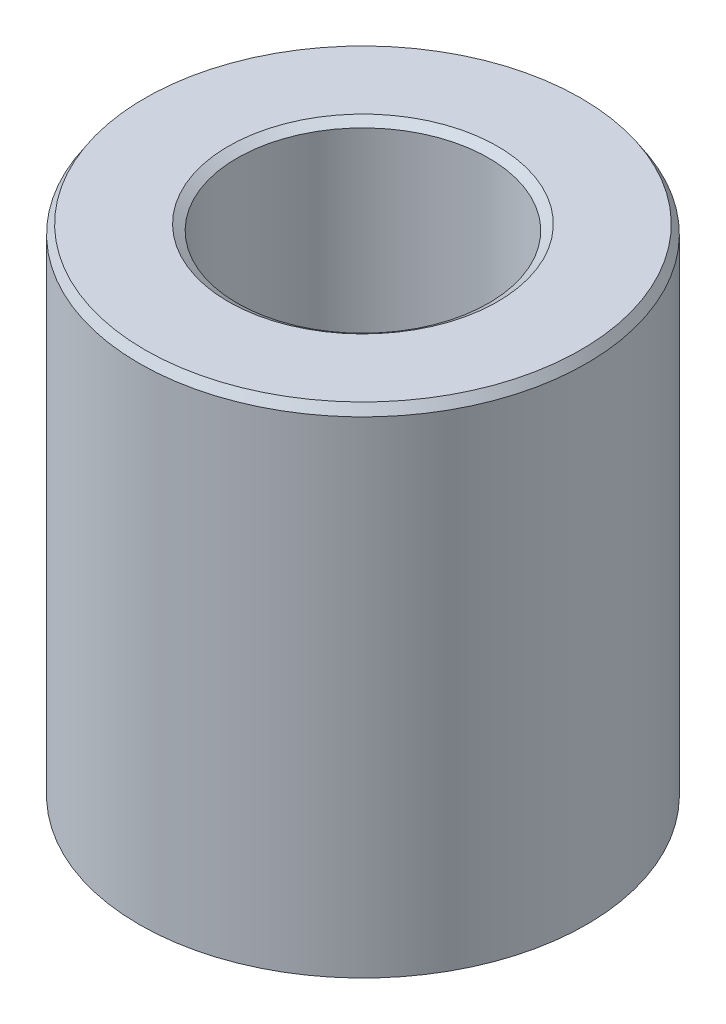
ISO-10303-21;
HEADER;
FILE_DESCRIPTION(('STEP AP214'),'2;1');
FILE_NAME('part.step','',(''),(''),'','','');
FILE_SCHEMA(('AUTOMOTIVE_DESIGN { 1 0 10303 214 1 1 1 1 }'));
ENDSEC;
DATA;
#1=APPLICATION_CONTEXT('core data for automotive mechanical design processes');
#2=APPLICATION_PROTOCOL_DEFINITION('international standard','automotive_design',2000,#1);
#3=PRODUCT_CONTEXT('',#1,'mechanical');
#4=PRODUCT('Part','Part','',(#3));
#5=PRODUCT_RELATED_PRODUCT_CATEGORY('part','',(#4));
#6=PRODUCT_DEFINITION_FORMATION('','',#4);
#7=PRODUCT_DEFINITION_CONTEXT('part definition',#1,'design');
#8=PRODUCT_DEFINITION('design','',#6,#7);
#9=PRODUCT_DEFINITION_SHAPE('','',#8);
#10=(LENGTH_UNIT() NAMED_UNIT(*) SI_UNIT(.MILLI.,.METRE.));
#11=(NAMED_UNIT(*) PLANE_ANGLE_UNIT() SI_UNIT($,.RADIAN.));
#12=(NAMED_UNIT(*) SI_UNIT($,.STERADIAN.) SOLID_ANGLE_UNIT());
#13=UNCERTAINTY_MEASURE_WITH_UNIT(LENGTH_MEASURE(1.E-05),#10,'distance_accuracy_value','');
#14=(GEOMETRIC_REPRESENTATION_CONTEXT(3) GLOBAL_UNCERTAINTY_ASSIGNED_CONTEXT((#13)) GLOBAL_UNIT_ASSIGNED_CONTEXT((#10,
#11,#12)) REPRESENTATION_CONTEXT('',''));
#15=CARTESIAN_POINT('',(0.,0.,0.));
#16=DIRECTION('',(0.,0.,1.));
#17=DIRECTION('',(1.,0.,0.));
#18=AXIS2_PLACEMENT_3D('',#15,#16,#17);
#19=CARTESIAN_POINT('',(0.,72.7110200263781,0.));
#20=DIRECTION('',(0.,-1.,0.));
#21=DIRECTION('',(0.,0.,-1.));
#22=AXIS2_PLACEMENT_3D('',#19,#20,#21);
#23=CYLINDRICAL_SURFACE('',#22,32.5);
#24=CARTESIAN_POINT('',(0.,0.829573823321814,0.));
#25=DIRECTION('',(0.,1.,0.));
#26=DIRECTION('',(0.,0.,1.));
#27=AXIS2_PLACEMENT_3D('',#24,#25,#26);
#28=CIRCLE('',#27,32.5);
#29=CARTESIAN_POINT('',(0.,0.829573823321814,32.5));
#30=VERTEX_POINT('',#29);
#31=EDGE_CURVE('E10',#30,#30,#28,.T.);
#32=ORIENTED_EDGE('',*,*,#31,.T.);
#33=EDGE_LOOP('',(#32));
#34=FACE_BOUND('',#33,.T.);
#35=CARTESIAN_POINT('',(0.,71.4206490765775,0.));
#36=DIRECTION('',(0.,1.,0.));
#37=DIRECTION('',(0.,0.,1.));
#38=AXIS2_PLACEMENT_3D('',#35,#36,#37);
#39=CIRCLE('',#38,32.5);
#40=CARTESIAN_POINT('',(0.,71.4206490765775,32.5));
#41=VERTEX_POINT('',#40);
#42=EDGE_CURVE('E50',#41,#41,#39,.F.);
#43=ORIENTED_EDGE('',*,*,#42,.T.);
#44=EDGE_LOOP('',(#43));
#45=FACE_BOUND('',#44,.T.);
#46=ADVANCED_FACE('F39',(#34,#45),#23,.T.);
#47=CARTESIAN_POINT('',(0.,72.7110200263781,0.));
#48=DIRECTION('',(0.,1.,0.));
#49=DIRECTION('',(0.,0.,1.));
#50=AXIS2_PLACEMENT_3D('',#47,#48,#49);
#51=PLANE('',#50);
#52=CARTESIAN_POINT('',(0.,72.7110200263781,0.));
#53=DIRECTION('',(0.,1.,0.));
#54=DIRECTION('',(0.,0.,1.));
#55=AXIS2_PLACEMENT_3D('',#52,#53,#54);
#56=CIRCLE('',#55,19.5573936205239);
#57=CARTESIAN_POINT('',(0.,72.7110200263781,19.5573936205239));
#58=VERTEX_POINT('',#57);
#59=EDGE_CURVE('E58',#58,#58,#56,.F.);
#60=ORIENTED_EDGE('',*,*,#59,.T.);
#61=EDGE_LOOP('',(#60));
#62=FACE_BOUND('',#61,.T.);
#63=CARTESIAN_POINT('',(0.,72.7110200263781,0.));
#64=DIRECTION('',(0.,1.,0.));
#65=DIRECTION('',(0.,0.,1.));
#66=AXIS2_PLACEMENT_3D('',#63,#64,#65);
#67=CIRCLE('',#66,31.6704261766782);
#68=CARTESIAN_POINT('',(0.,72.7110200263781,31.6704261766782));
#69=VERTEX_POINT('',#68);
#70=EDGE_CURVE('E61',#69,#69,#67,.T.);
#71=ORIENTED_EDGE('',*,*,#70,.T.);
#72=EDGE_LOOP('',(#71));
#73=FACE_BOUND('',#72,.T.);
#74=ADVANCED_FACE('F88',(#62,#73),#51,.T.);
#75=CARTESIAN_POINT('',(0.,0.,0.));
#76=DIRECTION('',(0.,1.,0.));
#77=DIRECTION('',(0.,0.,1.));
#78=AXIS2_PLACEMENT_3D('',#75,#76,#77);
#79=PLANE('',#78);
#80=CARTESIAN_POINT('',(0.,0.,0.));
#81=DIRECTION('',(0.,1.,0.));
#82=DIRECTION('',(0.,0.,1.));
#83=AXIS2_PLACEMENT_3D('',#80,#81,#82);
#84=CIRCLE('',#83,19.096596494045);
#85=CARTESIAN_POINT('',(0.,0.,19.096596494045));
#86=VERTEX_POINT('',#85);
#87=EDGE_CURVE('E51',#86,#86,#84,.T.);
#88=ORIENTED_EDGE('',*,*,#87,.T.);
#89=EDGE_LOOP('',(#88));
#90=FACE_BOUND('',#89,.T.);
#91=CARTESIAN_POINT('',(0.,0.,0.));
#92=DIRECTION('',(0.,1.,0.));
#93=DIRECTION('',(0.,0.,1.));
#94=AXIS2_PLACEMENT_3D('',#91,#92,#93);
#95=CIRCLE('',#94,31.2096290501993);
#96=CARTESIAN_POINT('',(0.,0.,31.2096290501993));
#97=VERTEX_POINT('',#96);
#98=EDGE_CURVE('E54',#97,#97,#95,.F.);
#99=ORIENTED_EDGE('',*,*,#98,.T.);
#100=EDGE_LOOP('',(#99));
#101=FACE_BOUND('',#100,.T.);
#102=ADVANCED_FACE('F83',(#90,#101),#79,.F.);
#103=CARTESIAN_POINT('',(0.,72.7110200263781,0.));
#104=DIRECTION('',(0.,-1.,0.));
#105=DIRECTION('',(0.,0.,-1.));
#106=AXIS2_PLACEMENT_3D('',#103,#104,#105);
#107=CYLINDRICAL_SURFACE('',#106,18.2670226707232);
#108=CARTESIAN_POINT('',(0.,71.8814462030563,0.));
#109=DIRECTION('',(0.,1.,0.));
#110=DIRECTION('',(0.,0.,1.));
#111=AXIS2_PLACEMENT_3D('',#108,#109,#110);
#112=CIRCLE('',#111,18.2670226707232);
#113=CARTESIAN_POINT('',(0.,71.8814462030563,18.2670226707232));
#114=VERTEX_POINT('',#113);
#115=EDGE_CURVE('E67',#114,#114,#112,.T.);
#116=ORIENTED_EDGE('',*,*,#115,.T.);
#117=EDGE_LOOP('',(#116));
#118=FACE_BOUND('',#117,.T.);
#119=CARTESIAN_POINT('',(0.,1.29037094980071,0.));
#120=DIRECTION('',(0.,1.,0.));
#121=DIRECTION('',(0.,0.,1.));
#122=AXIS2_PLACEMENT_3D('',#119,#120,#121);
#123=CIRCLE('',#122,18.2670226707232);
#124=CARTESIAN_POINT('',(0.,1.29037094980071,18.2670226707232));
#125=VERTEX_POINT('',#124);
#126=EDGE_CURVE('E69',#125,#125,#123,.F.);
#127=ORIENTED_EDGE('',*,*,#126,.T.);
#128=EDGE_LOOP('',(#127));
#129=FACE_BOUND('',#128,.T.);
#130=ADVANCED_FACE('F71',(#118,#129),#107,.F.);
#131=CARTESIAN_POINT('',(0.,71.8814462030563,0.));
#132=DIRECTION('',(0.,1.,0.));
#133=DIRECTION('',(0.,0.,1.));
#134=AXIS2_PLACEMENT_3D('',#131,#132,#133);
#135=CONICAL_SURFACE('',#134,18.2670226707232,0.999431626383851);
#136=ORIENTED_EDGE('',*,*,#59,.F.);
#137=EDGE_LOOP('',(#136));
#138=FACE_BOUND('',#137,.T.);
#139=ORIENTED_EDGE('',*,*,#115,.F.);
#140=EDGE_LOOP('',(#139));
#141=FACE_BOUND('',#140,.T.);
#142=ADVANCED_FACE('F77',(#138,#141),#135,.F.);
#143=CARTESIAN_POINT('',(0.,0.,0.));
#144=DIRECTION('',(0.,-1.,0.));
#145=DIRECTION('',(0.,0.,-1.));
#146=AXIS2_PLACEMENT_3D('',#143,#144,#145);
#147=CONICAL_SURFACE('',#146,19.096596494045,0.571364700411036);
#148=ORIENTED_EDGE('',*,*,#126,.F.);
#149=EDGE_LOOP('',(#148));
#150=FACE_BOUND('',#149,.T.);
#151=ORIENTED_EDGE('',*,*,#87,.F.);
#152=EDGE_LOOP('',(#151));
#153=FACE_BOUND('',#152,.T.);
#154=ADVANCED_FACE('F73',(#150,#153),#147,.F.);
#155=CARTESIAN_POINT('',(0.,0.829573823321814,0.));
#156=DIRECTION('',(0.,1.,0.));
#157=DIRECTION('',(0.,0.,1.));
#158=AXIS2_PLACEMENT_3D('',#155,#156,#157);
#159=CONICAL_SURFACE('',#158,32.5,0.999431626383851);
#160=ORIENTED_EDGE('',*,*,#98,.F.);
#161=EDGE_LOOP('',(#160));
#162=FACE_BOUND('',#161,.T.);
#163=ORIENTED_EDGE('',*,*,#31,.F.);
#164=EDGE_LOOP('',(#163));
#165=FACE_BOUND('',#164,.T.);
#166=ADVANCED_FACE('F76',(#162,#165),#159,.T.);
#167=CARTESIAN_POINT('',(0.,72.7110200263781,0.));
#168=DIRECTION('',(0.,-1.,0.));
#169=DIRECTION('',(0.,0.,-1.));
#170=AXIS2_PLACEMENT_3D('',#167,#168,#169);
#171=CONICAL_SURFACE('',#170,31.6704261766782,0.571364700411048);
#172=ORIENTED_EDGE('',*,*,#42,.F.);
#173=EDGE_LOOP('',(#172));
#174=FACE_BOUND('',#173,.T.);
#175=ORIENTED_EDGE('',*,*,#70,.F.);
#176=EDGE_LOOP('',(#175));
#177=FACE_BOUND('',#176,.T.);
#178=ADVANCED_FACE('F45',(#174,#177),#171,.T.);
#179=CLOSED_SHELL('',(#46,#74,#102,#130,#142,#154,#166,#178));
#180=MANIFOLD_SOLID_BREP('B2',#179);
#181=ADVANCED_BREP_SHAPE_REPRESENTATION('',(#18,#180),#14);
#182=SHAPE_DEFINITION_REPRESENTATION(#9,#181);
ENDSEC;
END-ISO-10303-21;
